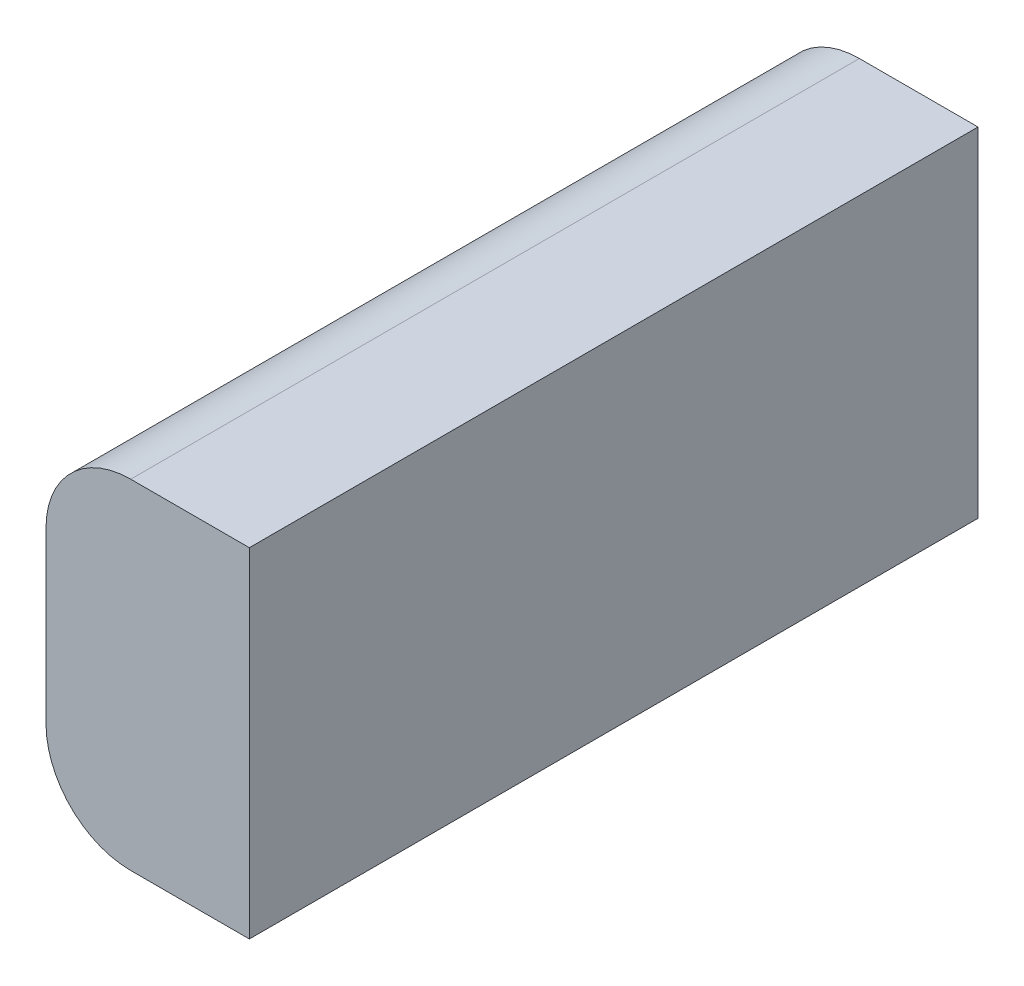
ISO-10303-21;
HEADER;
FILE_DESCRIPTION(('STEP AP214'),'2;1');
FILE_NAME('part.step','',(''),(''),'','','');
FILE_SCHEMA(('AUTOMOTIVE_DESIGN { 1 0 10303 214 1 1 1 1 }'));
ENDSEC;
DATA;
#1=APPLICATION_CONTEXT('core data for automotive mechanical design processes');
#2=APPLICATION_PROTOCOL_DEFINITION('international standard','automotive_design',2000,#1);
#3=PRODUCT_CONTEXT('',#1,'mechanical');
#4=PRODUCT('Part','Part','',(#3));
#5=PRODUCT_RELATED_PRODUCT_CATEGORY('part','',(#4));
#6=PRODUCT_DEFINITION_FORMATION('','',#4);
#7=PRODUCT_DEFINITION_CONTEXT('part definition',#1,'design');
#8=PRODUCT_DEFINITION('design','',#6,#7);
#9=PRODUCT_DEFINITION_SHAPE('','',#8);
#10=(LENGTH_UNIT() NAMED_UNIT(*) SI_UNIT(.MILLI.,.METRE.));
#11=(NAMED_UNIT(*) PLANE_ANGLE_UNIT() SI_UNIT($,.RADIAN.));
#12=(NAMED_UNIT(*) SI_UNIT($,.STERADIAN.) SOLID_ANGLE_UNIT());
#13=UNCERTAINTY_MEASURE_WITH_UNIT(LENGTH_MEASURE(1.E-05),#10,'distance_accuracy_value','');
#14=(GEOMETRIC_REPRESENTATION_CONTEXT(3) GLOBAL_UNCERTAINTY_ASSIGNED_CONTEXT((#13)) GLOBAL_UNIT_ASSIGNED_CONTEXT((#10,
#11,#12)) REPRESENTATION_CONTEXT('',''));
#15=CARTESIAN_POINT('',(0.,0.,0.));
#16=DIRECTION('',(0.,0.,1.));
#17=DIRECTION('',(1.,0.,0.));
#18=AXIS2_PLACEMENT_3D('',#15,#16,#17);
#19=CARTESIAN_POINT('',(-2.52010156029606,111.046798029557,273.05));
#20=DIRECTION('',(1.,0.,0.));
#21=DIRECTION('',(0.,1.,0.));
#22=AXIS2_PLACEMENT_3D('',#19,#20,#21);
#23=PLANE('',#22);
#24=DIRECTION('',(0.,-1.,0.));
#25=VECTOR('',#24,1.);
#26=CARTESIAN_POINT('',(-2.52010156029606,111.046798029557,0.));
#27=LINE('',#26,#25);
#28=CARTESIAN_POINT('',(-2.52010156029605,79.2967980295567,0.));
#29=VERTEX_POINT('',#28);
#30=CARTESIAN_POINT('',(-2.52010156029605,15.7967980295567,0.));
#31=VERTEX_POINT('',#30);
#32=EDGE_CURVE('E118',#29,#31,#27,.T.);
#33=ORIENTED_EDGE('',*,*,#32,.T.);
#34=DIRECTION('',(0.,0.,-1.));
#35=VECTOR('',#34,1.);
#36=CARTESIAN_POINT('',(-2.52010156029605,15.7967980295567,273.05));
#37=LINE('',#36,#35);
#38=CARTESIAN_POINT('',(-2.52010156029605,15.7967980295567,273.05));
#39=VERTEX_POINT('',#38);
#40=EDGE_CURVE('E56',#31,#39,#37,.F.);
#41=ORIENTED_EDGE('',*,*,#40,.T.);
#42=DIRECTION('',(0.,-1.,0.));
#43=VECTOR('',#42,1.);
#44=CARTESIAN_POINT('',(-2.52010156029606,111.046798029557,273.05));
#45=LINE('',#44,#43);
#46=CARTESIAN_POINT('',(-2.52010156029605,79.2967980295567,273.05));
#47=VERTEX_POINT('',#46);
#48=EDGE_CURVE('E99',#47,#39,#45,.T.);
#49=ORIENTED_EDGE('',*,*,#48,.F.);
#50=DIRECTION('',(0.,0.,-1.));
#51=VECTOR('',#50,1.);
#52=CARTESIAN_POINT('',(-2.52010156029605,79.2967980295567,273.05));
#53=LINE('',#52,#51);
#54=EDGE_CURVE('E131',#47,#29,#53,.T.);
#55=ORIENTED_EDGE('',*,*,#54,.T.);
#56=EDGE_LOOP('',(#33,#41,#49,#55));
#57=FACE_BOUND('',#56,.T.);
#58=ADVANCED_FACE('F35',(#57),#23,.F.);
#59=CARTESIAN_POINT('',(-2.52010156029604,-15.9532019704433,273.05));
#60=DIRECTION('',(0.,1.,0.));
#61=DIRECTION('',(0.,0.,1.));
#62=AXIS2_PLACEMENT_3D('',#59,#60,#61);
#63=PLANE('',#62);
#64=DIRECTION('',(1.,0.,0.));
#65=VECTOR('',#64,1.);
#66=CARTESIAN_POINT('',(-2.52010156029604,-15.9532019704433,273.05));
#67=LINE('',#66,#65);
#68=CARTESIAN_POINT('',(29.2298984397039,-15.9532019704433,273.05));
#69=VERTEX_POINT('',#68);
#70=CARTESIAN_POINT('',(73.679898439704,-15.9532019704433,273.05));
#71=VERTEX_POINT('',#70);
#72=EDGE_CURVE('E89',#69,#71,#67,.T.);
#73=ORIENTED_EDGE('',*,*,#72,.F.);
#74=DIRECTION('',(0.,0.,-1.));
#75=VECTOR('',#74,1.);
#76=CARTESIAN_POINT('',(29.229898439704,-15.9532019704433,273.05));
#77=LINE('',#76,#75);
#78=CARTESIAN_POINT('',(29.2298984397039,-15.9532019704433,0.));
#79=VERTEX_POINT('',#78);
#80=EDGE_CURVE('E108',#69,#79,#77,.T.);
#81=ORIENTED_EDGE('',*,*,#80,.T.);
#82=DIRECTION('',(1.,0.,0.));
#83=VECTOR('',#82,1.);
#84=CARTESIAN_POINT('',(-2.52010156029604,-15.9532019704433,0.));
#85=LINE('',#84,#83);
#86=CARTESIAN_POINT('',(73.679898439704,-15.9532019704433,0.));
#87=VERTEX_POINT('',#86);
#88=EDGE_CURVE('E105',#79,#87,#85,.T.);
#89=ORIENTED_EDGE('',*,*,#88,.T.);
#90=DIRECTION('',(0.,0.,-1.));
#91=VECTOR('',#90,1.);
#92=CARTESIAN_POINT('',(73.679898439704,-15.9532019704433,273.05));
#93=LINE('',#92,#91);
#94=EDGE_CURVE('E102',#71,#87,#93,.T.);
#95=ORIENTED_EDGE('',*,*,#94,.F.);
#96=EDGE_LOOP('',(#73,#81,#89,#95));
#97=FACE_BOUND('',#96,.T.);
#98=ADVANCED_FACE('F103',(#97),#63,.F.);
#99=CARTESIAN_POINT('',(73.6798984397039,111.046798029557,273.05));
#100=DIRECTION('',(-1.,0.,0.));
#101=DIRECTION('',(0.,-1.,0.));
#102=AXIS2_PLACEMENT_3D('',#99,#100,#101);
#103=PLANE('',#102);
#104=DIRECTION('',(0.,1.,0.));
#105=VECTOR('',#104,1.);
#106=CARTESIAN_POINT('',(73.6798984397039,111.046798029557,0.));
#107=LINE('',#106,#105);
#108=CARTESIAN_POINT('',(73.6798984397039,111.046798029557,0.));
#109=VERTEX_POINT('',#108);
#110=EDGE_CURVE('E121',#87,#109,#107,.T.);
#111=ORIENTED_EDGE('',*,*,#110,.T.);
#112=DIRECTION('',(0.,0.,-1.));
#113=VECTOR('',#112,1.);
#114=CARTESIAN_POINT('',(73.6798984397039,111.046798029557,273.05));
#115=LINE('',#114,#113);
#116=CARTESIAN_POINT('',(73.6798984397039,111.046798029557,273.05));
#117=VERTEX_POINT('',#116);
#118=EDGE_CURVE('E109',#117,#109,#115,.T.);
#119=ORIENTED_EDGE('',*,*,#118,.F.);
#120=DIRECTION('',(0.,1.,0.));
#121=VECTOR('',#120,1.);
#122=CARTESIAN_POINT('',(73.6798984397039,111.046798029557,273.05));
#123=LINE('',#122,#121);
#124=EDGE_CURVE('E93',#71,#117,#123,.T.);
#125=ORIENTED_EDGE('',*,*,#124,.F.);
#126=ORIENTED_EDGE('',*,*,#94,.T.);
#127=EDGE_LOOP('',(#111,#119,#125,#126));
#128=FACE_BOUND('',#127,.T.);
#129=ADVANCED_FACE('F111',(#128),#103,.F.);
#130=CARTESIAN_POINT('',(-2.52010156029606,111.046798029557,273.05));
#131=DIRECTION('',(0.,-1.,0.));
#132=DIRECTION('',(0.,0.,-1.));
#133=AXIS2_PLACEMENT_3D('',#130,#131,#132);
#134=PLANE('',#133);
#135=DIRECTION('',(-1.,0.,0.));
#136=VECTOR('',#135,1.);
#137=CARTESIAN_POINT('',(-2.52010156029606,111.046798029557,0.));
#138=LINE('',#137,#136);
#139=CARTESIAN_POINT('',(29.2298984397039,111.046798029557,0.));
#140=VERTEX_POINT('',#139);
#141=EDGE_CURVE('E123',#109,#140,#138,.T.);
#142=ORIENTED_EDGE('',*,*,#141,.T.);
#143=DIRECTION('',(0.,0.,-1.));
#144=VECTOR('',#143,1.);
#145=CARTESIAN_POINT('',(29.2298984397039,111.046798029557,273.05));
#146=LINE('',#145,#144);
#147=CARTESIAN_POINT('',(29.2298984397039,111.046798029557,273.05));
#148=VERTEX_POINT('',#147);
#149=EDGE_CURVE('E11',#140,#148,#146,.F.);
#150=ORIENTED_EDGE('',*,*,#149,.T.);
#151=DIRECTION('',(-1.,0.,0.));
#152=VECTOR('',#151,1.);
#153=CARTESIAN_POINT('',(-2.52010156029606,111.046798029557,273.05));
#154=LINE('',#153,#152);
#155=EDGE_CURVE('E113',#117,#148,#154,.T.);
#156=ORIENTED_EDGE('',*,*,#155,.F.);
#157=ORIENTED_EDGE('',*,*,#118,.T.);
#158=EDGE_LOOP('',(#142,#150,#156,#157));
#159=FACE_BOUND('',#158,.T.);
#160=ADVANCED_FACE('F143',(#159),#134,.F.);
#161=CARTESIAN_POINT('',(0.,0.,273.05));
#162=DIRECTION('',(0.,0.,1.));
#163=DIRECTION('',(1.,0.,0.));
#164=AXIS2_PLACEMENT_3D('',#161,#162,#163);
#165=PLANE('',#164);
#166=ORIENTED_EDGE('',*,*,#48,.T.);
#167=CARTESIAN_POINT('',(29.229898439704,15.7967980295567,273.05));
#168=DIRECTION('',(0.,0.,1.));
#169=DIRECTION('',(1.,0.,0.));
#170=AXIS2_PLACEMENT_3D('',#167,#168,#169);
#171=CIRCLE('',#170,31.75);
#172=EDGE_CURVE('E43',#39,#69,#171,.T.);
#173=ORIENTED_EDGE('',*,*,#172,.T.);
#174=ORIENTED_EDGE('',*,*,#72,.T.);
#175=ORIENTED_EDGE('',*,*,#124,.T.);
#176=ORIENTED_EDGE('',*,*,#155,.T.);
#177=CARTESIAN_POINT('',(29.2298984397039,79.2967980295567,273.05));
#178=DIRECTION('',(0.,0.,1.));
#179=DIRECTION('',(1.,0.,0.));
#180=AXIS2_PLACEMENT_3D('',#177,#178,#179);
#181=CIRCLE('',#180,31.75);
#182=EDGE_CURVE('E135',#148,#47,#181,.T.);
#183=ORIENTED_EDGE('',*,*,#182,.T.);
#184=EDGE_LOOP('',(#166,#173,#174,#175,#176,#183));
#185=FACE_BOUND('',#184,.T.);
#186=ADVANCED_FACE('F91',(#185),#165,.T.);
#187=CARTESIAN_POINT('',(0.,0.,0.));
#188=DIRECTION('',(0.,0.,1.));
#189=DIRECTION('',(1.,0.,0.));
#190=AXIS2_PLACEMENT_3D('',#187,#188,#189);
#191=PLANE('',#190);
#192=ORIENTED_EDGE('',*,*,#88,.F.);
#193=CARTESIAN_POINT('',(29.229898439704,15.7967980295567,0.));
#194=DIRECTION('',(0.,0.,1.));
#195=DIRECTION('',(1.,0.,0.));
#196=AXIS2_PLACEMENT_3D('',#193,#194,#195);
#197=CIRCLE('',#196,31.75);
#198=EDGE_CURVE('E129',#79,#31,#197,.F.);
#199=ORIENTED_EDGE('',*,*,#198,.T.);
#200=ORIENTED_EDGE('',*,*,#32,.F.);
#201=CARTESIAN_POINT('',(29.2298984397039,79.2967980295567,0.));
#202=DIRECTION('',(0.,0.,1.));
#203=DIRECTION('',(1.,0.,0.));
#204=AXIS2_PLACEMENT_3D('',#201,#202,#203);
#205=CIRCLE('',#204,31.75);
#206=EDGE_CURVE('E127',#29,#140,#205,.F.);
#207=ORIENTED_EDGE('',*,*,#206,.T.);
#208=ORIENTED_EDGE('',*,*,#141,.F.);
#209=ORIENTED_EDGE('',*,*,#110,.F.);
#210=EDGE_LOOP('',(#192,#199,#200,#207,#208,#209));
#211=FACE_BOUND('',#210,.T.);
#212=ADVANCED_FACE('F142',(#211),#191,.F.);
#213=CARTESIAN_POINT('',(29.229898439704,15.7967980295567,273.05));
#214=DIRECTION('',(0.,0.,-1.));
#215=DIRECTION('',(-1.,0.,0.));
#216=AXIS2_PLACEMENT_3D('',#213,#214,#215);
#217=CYLINDRICAL_SURFACE('',#216,31.75);
#218=ORIENTED_EDGE('',*,*,#172,.F.);
#219=ORIENTED_EDGE('',*,*,#40,.F.);
#220=ORIENTED_EDGE('',*,*,#198,.F.);
#221=ORIENTED_EDGE('',*,*,#80,.F.);
#222=EDGE_LOOP('',(#218,#219,#220,#221));
#223=FACE_BOUND('',#222,.T.);
#224=ADVANCED_FACE('F159',(#223),#217,.T.);
#225=CARTESIAN_POINT('',(29.2298984397039,79.2967980295567,273.05));
#226=DIRECTION('',(0.,0.,-1.));
#227=DIRECTION('',(-1.,0.,0.));
#228=AXIS2_PLACEMENT_3D('',#225,#226,#227);
#229=CYLINDRICAL_SURFACE('',#228,31.75);
#230=ORIENTED_EDGE('',*,*,#182,.F.);
#231=ORIENTED_EDGE('',*,*,#149,.F.);
#232=ORIENTED_EDGE('',*,*,#206,.F.);
#233=ORIENTED_EDGE('',*,*,#54,.F.);
#234=EDGE_LOOP('',(#230,#231,#232,#233));
#235=FACE_BOUND('',#234,.T.);
#236=ADVANCED_FACE('F37',(#235),#229,.T.);
#237=CLOSED_SHELL('',(#58,#98,#129,#160,#186,#212,#224,#236));
#238=MANIFOLD_SOLID_BREP('B2',#237);
#239=ADVANCED_BREP_SHAPE_REPRESENTATION('',(#18,#238),#14);
#240=SHAPE_DEFINITION_REPRESENTATION(#9,#239);
ENDSEC;
END-ISO-10303-21;
